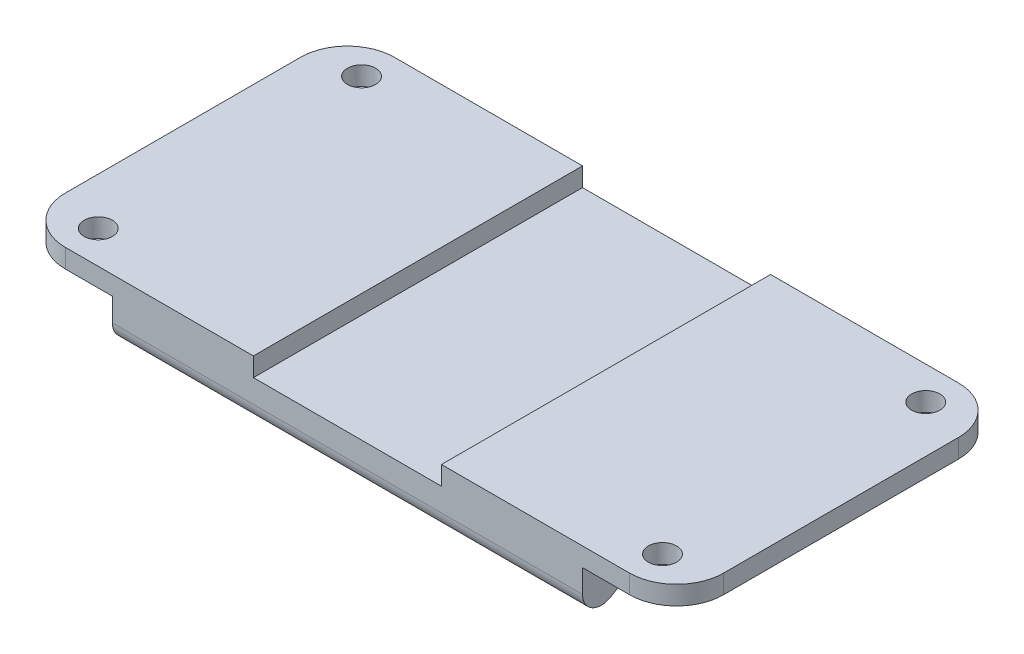
ISO-10303-21;
HEADER;
FILE_DESCRIPTION(('STEP AP214'),'2;1');
FILE_NAME('part.step','',(''),(''),'','','');
FILE_SCHEMA(('AUTOMOTIVE_DESIGN { 1 0 10303 214 1 1 1 1 }'));
ENDSEC;
DATA;
#1=APPLICATION_CONTEXT('core data for automotive mechanical design processes');
#2=APPLICATION_PROTOCOL_DEFINITION('international standard','automotive_design',2000,#1);
#3=PRODUCT_CONTEXT('',#1,'mechanical');
#4=PRODUCT('Part','Part','',(#3));
#5=PRODUCT_RELATED_PRODUCT_CATEGORY('part','',(#4));
#6=PRODUCT_DEFINITION_FORMATION('','',#4);
#7=PRODUCT_DEFINITION_CONTEXT('part definition',#1,'design');
#8=PRODUCT_DEFINITION('design','',#6,#7);
#9=PRODUCT_DEFINITION_SHAPE('','',#8);
#10=(LENGTH_UNIT() NAMED_UNIT(*) SI_UNIT(.MILLI.,.METRE.));
#11=(NAMED_UNIT(*) PLANE_ANGLE_UNIT() SI_UNIT($,.RADIAN.));
#12=(NAMED_UNIT(*) SI_UNIT($,.STERADIAN.) SOLID_ANGLE_UNIT());
#13=UNCERTAINTY_MEASURE_WITH_UNIT(LENGTH_MEASURE(1.E-05),#10,'distance_accuracy_value','');
#14=(GEOMETRIC_REPRESENTATION_CONTEXT(3) GLOBAL_UNCERTAINTY_ASSIGNED_CONTEXT((#13)) GLOBAL_UNIT_ASSIGNED_CONTEXT((#10,
#11,#12)) REPRESENTATION_CONTEXT('',''));
#15=CARTESIAN_POINT('',(0.,0.,0.));
#16=DIRECTION('',(0.,0.,1.));
#17=DIRECTION('',(1.,0.,0.));
#18=AXIS2_PLACEMENT_3D('',#15,#16,#17);
#19=CARTESIAN_POINT('',(0.,0.,0.));
#20=DIRECTION('',(0.,1.,0.));
#21=DIRECTION('',(0.,0.,1.));
#22=AXIS2_PLACEMENT_3D('',#19,#20,#21);
#23=PLANE('',#22);
#24=CARTESIAN_POINT('',(30.,0.,14.));
#25=DIRECTION('',(0.,1.,0.));
#26=DIRECTION('',(0.,0.,1.));
#27=AXIS2_PLACEMENT_3D('',#24,#25,#26);
#28=CIRCLE('',#27,1.5);
#29=CARTESIAN_POINT('',(30.,0.,15.5));
#30=VERTEX_POINT('',#29);
#31=EDGE_CURVE('E430',#30,#30,#28,.T.);
#32=ORIENTED_EDGE('',*,*,#31,.F.);
#33=EDGE_LOOP('',(#32));
#34=FACE_BOUND('',#33,.T.);
#35=CARTESIAN_POINT('',(30.,0.,-14.));
#36=DIRECTION('',(0.,1.,0.));
#37=DIRECTION('',(0.,0.,1.));
#38=AXIS2_PLACEMENT_3D('',#35,#36,#37);
#39=CIRCLE('',#38,1.5);
#40=CARTESIAN_POINT('',(30.,0.,-12.5));
#41=VERTEX_POINT('',#40);
#42=EDGE_CURVE('E445',#41,#41,#39,.F.);
#43=ORIENTED_EDGE('',*,*,#42,.T.);
#44=EDGE_LOOP('',(#43));
#45=FACE_BOUND('',#44,.T.);
#46=DIRECTION('',(1.,0.,0.));
#47=VECTOR('',#46,1.);
#48=CARTESIAN_POINT('',(25.,0.,17.5));
#49=LINE('',#48,#47);
#50=CARTESIAN_POINT('',(10.,0.,17.5));
#51=VERTEX_POINT('',#50);
#52=CARTESIAN_POINT('',(30.,0.,17.5));
#53=VERTEX_POINT('',#52);
#54=EDGE_CURVE('E212',#51,#53,#49,.T.);
#55=ORIENTED_EDGE('',*,*,#54,.T.);
#56=CARTESIAN_POINT('',(30.,0.,12.5));
#57=DIRECTION('',(0.,1.,0.));
#58=DIRECTION('',(0.,0.,1.));
#59=AXIS2_PLACEMENT_3D('',#56,#57,#58);
#60=CIRCLE('',#59,5.);
#61=CARTESIAN_POINT('',(35.,0.,12.5));
#62=VERTEX_POINT('',#61);
#63=EDGE_CURVE('E287',#53,#62,#60,.T.);
#64=ORIENTED_EDGE('',*,*,#63,.T.);
#65=DIRECTION('',(0.,0.,-1.));
#66=VECTOR('',#65,1.);
#67=CARTESIAN_POINT('',(35.,0.,0.));
#68=LINE('',#67,#66);
#69=CARTESIAN_POINT('',(35.,0.,-12.5));
#70=VERTEX_POINT('',#69);
#71=EDGE_CURVE('E374',#62,#70,#68,.T.);
#72=ORIENTED_EDGE('',*,*,#71,.T.);
#73=CARTESIAN_POINT('',(30.,0.,-12.5));
#74=DIRECTION('',(0.,1.,0.));
#75=DIRECTION('',(0.,0.,1.));
#76=AXIS2_PLACEMENT_3D('',#73,#74,#75);
#77=CIRCLE('',#76,5.);
#78=CARTESIAN_POINT('',(30.,0.,-17.5));
#79=VERTEX_POINT('',#78);
#80=EDGE_CURVE('E285',#70,#79,#77,.T.);
#81=ORIENTED_EDGE('',*,*,#80,.T.);
#82=DIRECTION('',(-1.,0.,0.));
#83=VECTOR('',#82,1.);
#84=CARTESIAN_POINT('',(25.,0.,-17.5));
#85=LINE('',#84,#83);
#86=CARTESIAN_POINT('',(10.,0.,-17.5));
#87=VERTEX_POINT('',#86);
#88=EDGE_CURVE('E209',#79,#87,#85,.T.);
#89=ORIENTED_EDGE('',*,*,#88,.T.);
#90=DIRECTION('',(0.,0.,1.));
#91=VECTOR('',#90,1.);
#92=CARTESIAN_POINT('',(10.,0.,-17.5));
#93=LINE('',#92,#91);
#94=EDGE_CURVE('E361',#87,#51,#93,.T.);
#95=ORIENTED_EDGE('',*,*,#94,.T.);
#96=EDGE_LOOP('',(#55,#64,#72,#81,#89,#95));
#97=FACE_BOUND('',#96,.T.);
#98=ADVANCED_FACE('F34',(#34,#45,#97),#23,.T.);
#99=CARTESIAN_POINT('',(25.,-8.,-17.5));
#100=DIRECTION('',(0.,0.,-1.));
#101=DIRECTION('',(-1.,0.,0.));
#102=AXIS2_PLACEMENT_3D('',#99,#100,#101);
#103=PLANE('',#102);
#104=ORIENTED_EDGE('',*,*,#88,.F.);
#105=DIRECTION('',(0.,-1.,0.));
#106=VECTOR('',#105,1.);
#107=CARTESIAN_POINT('',(30.,-8.,-17.5));
#108=LINE('',#107,#106);
#109=CARTESIAN_POINT('',(30.,-2.,-17.5));
#110=VERTEX_POINT('',#109);
#111=EDGE_CURVE('E298',#79,#110,#108,.T.);
#112=ORIENTED_EDGE('',*,*,#111,.T.);
#113=DIRECTION('',(-1.,0.,0.));
#114=VECTOR('',#113,1.);
#115=CARTESIAN_POINT('',(35.,-2.,-17.5));
#116=LINE('',#115,#114);
#117=CARTESIAN_POINT('',(25.,-2.,-17.5));
#118=VERTEX_POINT('',#117);
#119=EDGE_CURVE('E379',#110,#118,#116,.T.);
#120=ORIENTED_EDGE('',*,*,#119,.T.);
#121=DIRECTION('',(0.,1.,0.));
#122=VECTOR('',#121,1.);
#123=CARTESIAN_POINT('',(25.,-8.,-17.5));
#124=LINE('',#123,#122);
#125=CARTESIAN_POINT('',(25.,-4.46761924206188,-17.5));
#126=VERTEX_POINT('',#125);
#127=EDGE_CURVE('E220',#126,#118,#124,.T.);
#128=ORIENTED_EDGE('',*,*,#127,.F.);
#129=DIRECTION('',(-1.,0.,0.));
#130=VECTOR('',#129,1.);
#131=CARTESIAN_POINT('',(-25.,-4.46761924206187,-17.5));
#132=LINE('',#131,#130);
#133=CARTESIAN_POINT('',(-25.,-4.46761924206187,-17.5));
#134=VERTEX_POINT('',#133);
#135=EDGE_CURVE('E244',#126,#134,#132,.T.);
#136=ORIENTED_EDGE('',*,*,#135,.T.);
#137=DIRECTION('',(0.,1.,0.));
#138=VECTOR('',#137,1.);
#139=CARTESIAN_POINT('',(-25.,-8.,-17.5));
#140=LINE('',#139,#138);
#141=CARTESIAN_POINT('',(-25.,-2.,-17.5));
#142=VERTEX_POINT('',#141);
#143=EDGE_CURVE('E216',#134,#142,#140,.T.);
#144=ORIENTED_EDGE('',*,*,#143,.T.);
#145=DIRECTION('',(1.,0.,0.));
#146=VECTOR('',#145,1.);
#147=CARTESIAN_POINT('',(-35.,-2.,-17.5));
#148=LINE('',#147,#146);
#149=CARTESIAN_POINT('',(-30.,-2.,-17.5));
#150=VERTEX_POINT('',#149);
#151=EDGE_CURVE('E337',#150,#142,#148,.T.);
#152=ORIENTED_EDGE('',*,*,#151,.F.);
#153=DIRECTION('',(0.,-1.,0.));
#154=VECTOR('',#153,1.);
#155=CARTESIAN_POINT('',(-30.,-8.,-17.5));
#156=LINE('',#155,#154);
#157=CARTESIAN_POINT('',(-30.,0.,-17.5));
#158=VERTEX_POINT('',#157);
#159=EDGE_CURVE('E208',#150,#158,#156,.F.);
#160=ORIENTED_EDGE('',*,*,#159,.T.);
#161=CARTESIAN_POINT('',(-10.,0.,-17.5));
#162=VERTEX_POINT('',#161);
#163=EDGE_CURVE('E199',#162,#158,#85,.T.);
#164=ORIENTED_EDGE('',*,*,#163,.F.);
#165=DIRECTION('',(0.,-1.,0.));
#166=VECTOR('',#165,1.);
#167=CARTESIAN_POINT('',(-10.,0.,-17.5));
#168=LINE('',#167,#166);
#169=CARTESIAN_POINT('',(-10.,-2.,-17.5));
#170=VERTEX_POINT('',#169);
#171=EDGE_CURVE('E183',#162,#170,#168,.T.);
#172=ORIENTED_EDGE('',*,*,#171,.T.);
#173=DIRECTION('',(1.,0.,0.));
#174=VECTOR('',#173,1.);
#175=CARTESIAN_POINT('',(0.,-2.,-17.5));
#176=LINE('',#175,#174);
#177=CARTESIAN_POINT('',(10.,-2.,-17.5));
#178=VERTEX_POINT('',#177);
#179=EDGE_CURVE('E194',#170,#178,#176,.T.);
#180=ORIENTED_EDGE('',*,*,#179,.T.);
#181=DIRECTION('',(0.,-1.,0.));
#182=VECTOR('',#181,1.);
#183=CARTESIAN_POINT('',(10.,0.,-17.5));
#184=LINE('',#183,#182);
#185=EDGE_CURVE('E202',#87,#178,#184,.T.);
#186=ORIENTED_EDGE('',*,*,#185,.F.);
#187=EDGE_LOOP('',(#104,#112,#120,#128,#136,#144,#152,#160,#164,#172,#180,#186));
#188=FACE_BOUND('',#187,.T.);
#189=ADVANCED_FACE('F205',(#188),#103,.T.);
#190=CARTESIAN_POINT('',(25.,-8.,17.5));
#191=DIRECTION('',(0.,0.,1.));
#192=DIRECTION('',(1.,0.,0.));
#193=AXIS2_PLACEMENT_3D('',#190,#191,#192);
#194=PLANE('',#193);
#195=DIRECTION('',(-1.,0.,0.));
#196=VECTOR('',#195,1.);
#197=CARTESIAN_POINT('',(35.,-2.,17.5));
#198=LINE('',#197,#196);
#199=CARTESIAN_POINT('',(30.,-2.,17.5));
#200=VERTEX_POINT('',#199);
#201=CARTESIAN_POINT('',(25.,-2.,17.5));
#202=VERTEX_POINT('',#201);
#203=EDGE_CURVE('E331',#200,#202,#198,.T.);
#204=ORIENTED_EDGE('',*,*,#203,.F.);
#205=DIRECTION('',(0.,1.,0.));
#206=VECTOR('',#205,1.);
#207=CARTESIAN_POINT('',(30.,-8.,17.5));
#208=LINE('',#207,#206);
#209=EDGE_CURVE('E282',#200,#53,#208,.T.);
#210=ORIENTED_EDGE('',*,*,#209,.T.);
#211=ORIENTED_EDGE('',*,*,#54,.F.);
#212=DIRECTION('',(0.,-1.,0.));
#213=VECTOR('',#212,1.);
#214=CARTESIAN_POINT('',(10.,0.,17.5));
#215=LINE('',#214,#213);
#216=CARTESIAN_POINT('',(10.,-2.,17.5));
#217=VERTEX_POINT('',#216);
#218=EDGE_CURVE('E195',#51,#217,#215,.T.);
#219=ORIENTED_EDGE('',*,*,#218,.T.);
#220=DIRECTION('',(1.,0.,0.));
#221=VECTOR('',#220,1.);
#222=CARTESIAN_POINT('',(0.,-2.,17.5));
#223=LINE('',#222,#221);
#224=CARTESIAN_POINT('',(-10.,-2.,17.5));
#225=VERTEX_POINT('',#224);
#226=EDGE_CURVE('E437',#225,#217,#223,.T.);
#227=ORIENTED_EDGE('',*,*,#226,.F.);
#228=DIRECTION('',(0.,-1.,0.));
#229=VECTOR('',#228,1.);
#230=CARTESIAN_POINT('',(-10.,0.,17.5));
#231=LINE('',#230,#229);
#232=CARTESIAN_POINT('',(-10.,0.,17.5));
#233=VERTEX_POINT('',#232);
#234=EDGE_CURVE('E315',#233,#225,#231,.T.);
#235=ORIENTED_EDGE('',*,*,#234,.F.);
#236=CARTESIAN_POINT('',(-30.,0.,17.5));
#237=VERTEX_POINT('',#236);
#238=EDGE_CURVE('E201',#237,#233,#49,.T.);
#239=ORIENTED_EDGE('',*,*,#238,.F.);
#240=DIRECTION('',(0.,1.,0.));
#241=VECTOR('',#240,1.);
#242=CARTESIAN_POINT('',(-30.,-8.,17.5));
#243=LINE('',#242,#241);
#244=CARTESIAN_POINT('',(-30.,-2.,17.5));
#245=VERTEX_POINT('',#244);
#246=EDGE_CURVE('E266',#237,#245,#243,.F.);
#247=ORIENTED_EDGE('',*,*,#246,.T.);
#248=DIRECTION('',(1.,0.,0.));
#249=VECTOR('',#248,1.);
#250=CARTESIAN_POINT('',(-35.,-2.,17.5));
#251=LINE('',#250,#249);
#252=CARTESIAN_POINT('',(-25.,-2.,17.5));
#253=VERTEX_POINT('',#252);
#254=EDGE_CURVE('E324',#245,#253,#251,.T.);
#255=ORIENTED_EDGE('',*,*,#254,.T.);
#256=DIRECTION('',(0.,1.,0.));
#257=VECTOR('',#256,1.);
#258=CARTESIAN_POINT('',(-25.,-8.,17.5));
#259=LINE('',#258,#257);
#260=CARTESIAN_POINT('',(-25.,-4.46761924206188,17.5));
#261=VERTEX_POINT('',#260);
#262=EDGE_CURVE('E211',#261,#253,#259,.T.);
#263=ORIENTED_EDGE('',*,*,#262,.F.);
#264=DIRECTION('',(1.,0.,0.));
#265=VECTOR('',#264,1.);
#266=CARTESIAN_POINT('',(25.,-4.46761924206188,17.5));
#267=LINE('',#266,#265);
#268=CARTESIAN_POINT('',(25.,-4.46761924206188,17.5));
#269=VERTEX_POINT('',#268);
#270=EDGE_CURVE('E255',#261,#269,#267,.T.);
#271=ORIENTED_EDGE('',*,*,#270,.T.);
#272=DIRECTION('',(0.,1.,0.));
#273=VECTOR('',#272,1.);
#274=CARTESIAN_POINT('',(25.,-8.,17.5));
#275=LINE('',#274,#273);
#276=EDGE_CURVE('E223',#269,#202,#275,.T.);
#277=ORIENTED_EDGE('',*,*,#276,.T.);
#278=EDGE_LOOP('',(#204,#210,#211,#219,#227,#235,#239,#247,#255,#263,#271,#277));
#279=FACE_BOUND('',#278,.T.);
#280=ADVANCED_FACE('F312',(#279),#194,.T.);
#281=ORIENTED_EDGE('',*,*,#163,.T.);
#282=CARTESIAN_POINT('',(-30.,0.,-12.5));
#283=DIRECTION('',(0.,1.,0.));
#284=DIRECTION('',(0.,0.,1.));
#285=AXIS2_PLACEMENT_3D('',#282,#283,#284);
#286=CIRCLE('',#285,5.);
#287=CARTESIAN_POINT('',(-35.,0.,-12.5));
#288=VERTEX_POINT('',#287);
#289=EDGE_CURVE('E11',#158,#288,#286,.T.);
#290=ORIENTED_EDGE('',*,*,#289,.T.);
#291=DIRECTION('',(0.,0.,-1.));
#292=VECTOR('',#291,1.);
#293=CARTESIAN_POINT('',(-35.,0.,0.));
#294=LINE('',#293,#292);
#295=CARTESIAN_POINT('',(-35.,0.,12.5));
#296=VERTEX_POINT('',#295);
#297=EDGE_CURVE('E309',#296,#288,#294,.T.);
#298=ORIENTED_EDGE('',*,*,#297,.F.);
#299=CARTESIAN_POINT('',(-30.,0.,12.5));
#300=DIRECTION('',(0.,1.,0.));
#301=DIRECTION('',(0.,0.,1.));
#302=AXIS2_PLACEMENT_3D('',#299,#300,#301);
#303=CIRCLE('',#302,5.);
#304=EDGE_CURVE('E42',#296,#237,#303,.T.);
#305=ORIENTED_EDGE('',*,*,#304,.T.);
#306=ORIENTED_EDGE('',*,*,#238,.T.);
#307=DIRECTION('',(0.,0.,1.));
#308=VECTOR('',#307,1.);
#309=CARTESIAN_POINT('',(-10.,0.,-17.5));
#310=LINE('',#309,#308);
#311=EDGE_CURVE('E187',#162,#233,#310,.T.);
#312=ORIENTED_EDGE('',*,*,#311,.F.);
#313=EDGE_LOOP('',(#281,#290,#298,#305,#306,#312));
#314=FACE_BOUND('',#313,.T.);
#315=CARTESIAN_POINT('',(-30.,0.,-14.));
#316=DIRECTION('',(0.,1.,0.));
#317=DIRECTION('',(0.,0.,1.));
#318=AXIS2_PLACEMENT_3D('',#315,#316,#317);
#319=CIRCLE('',#318,1.5);
#320=CARTESIAN_POINT('',(-30.,0.,-12.5));
#321=VERTEX_POINT('',#320);
#322=EDGE_CURVE('E271',#321,#321,#319,.T.);
#323=ORIENTED_EDGE('',*,*,#322,.F.);
#324=EDGE_LOOP('',(#323));
#325=FACE_BOUND('',#324,.T.);
#326=CARTESIAN_POINT('',(-30.,0.,14.));
#327=DIRECTION('',(0.,1.,0.));
#328=DIRECTION('',(0.,0.,1.));
#329=AXIS2_PLACEMENT_3D('',#326,#327,#328);
#330=CIRCLE('',#329,1.5);
#331=CARTESIAN_POINT('',(-30.,0.,15.5));
#332=VERTEX_POINT('',#331);
#333=EDGE_CURVE('E446',#332,#332,#330,.F.);
#334=ORIENTED_EDGE('',*,*,#333,.T.);
#335=EDGE_LOOP('',(#334));
#336=FACE_BOUND('',#335,.T.);
#337=ADVANCED_FACE('F197',(#314,#325,#336),#23,.T.);
#338=CARTESIAN_POINT('',(-35.,-2.,0.));
#339=DIRECTION('',(0.,1.,0.));
#340=DIRECTION('',(0.,0.,1.));
#341=AXIS2_PLACEMENT_3D('',#338,#339,#340);
#342=PLANE('',#341);
#343=CARTESIAN_POINT('',(-30.,-2.,-14.));
#344=DIRECTION('',(0.,1.,0.));
#345=DIRECTION('',(0.,0.,1.));
#346=AXIS2_PLACEMENT_3D('',#343,#344,#345);
#347=CIRCLE('',#346,1.5);
#348=CARTESIAN_POINT('',(-30.,-2.,-12.5));
#349=VERTEX_POINT('',#348);
#350=EDGE_CURVE('E274',#349,#349,#347,.T.);
#351=ORIENTED_EDGE('',*,*,#350,.T.);
#352=EDGE_LOOP('',(#351));
#353=FACE_BOUND('',#352,.T.);
#354=DIRECTION('',(0.,0.,1.));
#355=VECTOR('',#354,1.);
#356=CARTESIAN_POINT('',(-35.,-2.,0.));
#357=LINE('',#356,#355);
#358=CARTESIAN_POINT('',(-35.,-2.,-12.5));
#359=VERTEX_POINT('',#358);
#360=CARTESIAN_POINT('',(-35.,-2.,12.5));
#361=VERTEX_POINT('',#360);
#362=EDGE_CURVE('E322',#359,#361,#357,.T.);
#363=ORIENTED_EDGE('',*,*,#362,.F.);
#364=CARTESIAN_POINT('',(-30.,-2.,-12.5));
#365=DIRECTION('',(0.,1.,0.));
#366=DIRECTION('',(0.,0.,1.));
#367=AXIS2_PLACEMENT_3D('',#364,#365,#366);
#368=CIRCLE('',#367,5.);
#369=EDGE_CURVE('E308',#359,#150,#368,.F.);
#370=ORIENTED_EDGE('',*,*,#369,.T.);
#371=ORIENTED_EDGE('',*,*,#151,.T.);
#372=DIRECTION('',(0.,0.,1.));
#373=VECTOR('',#372,1.);
#374=CARTESIAN_POINT('',(-25.,-2.,0.));
#375=LINE('',#374,#373);
#376=EDGE_CURVE('E328',#142,#253,#375,.T.);
#377=ORIENTED_EDGE('',*,*,#376,.T.);
#378=ORIENTED_EDGE('',*,*,#254,.F.);
#379=CARTESIAN_POINT('',(-30.,-2.,12.5));
#380=DIRECTION('',(0.,1.,0.));
#381=DIRECTION('',(0.,0.,1.));
#382=AXIS2_PLACEMENT_3D('',#379,#380,#381);
#383=CIRCLE('',#382,5.);
#384=EDGE_CURVE('E306',#245,#361,#383,.F.);
#385=ORIENTED_EDGE('',*,*,#384,.T.);
#386=EDGE_LOOP('',(#363,#370,#371,#377,#378,#385));
#387=FACE_BOUND('',#386,.T.);
#388=CARTESIAN_POINT('',(-30.,-2.,14.));
#389=DIRECTION('',(0.,1.,0.));
#390=DIRECTION('',(0.,0.,1.));
#391=AXIS2_PLACEMENT_3D('',#388,#389,#390);
#392=CIRCLE('',#391,1.5);
#393=CARTESIAN_POINT('',(-30.,-2.,15.5));
#394=VERTEX_POINT('',#393);
#395=EDGE_CURVE('E277',#394,#394,#392,.F.);
#396=ORIENTED_EDGE('',*,*,#395,.F.);
#397=EDGE_LOOP('',(#396));
#398=FACE_BOUND('',#397,.T.);
#399=ADVANCED_FACE('F320',(#353,#387,#398),#342,.F.);
#400=CARTESIAN_POINT('',(35.,-2.,0.));
#401=DIRECTION('',(0.,-1.,0.));
#402=DIRECTION('',(0.,0.,-1.));
#403=AXIS2_PLACEMENT_3D('',#400,#401,#402);
#404=PLANE('',#403);
#405=DIRECTION('',(0.,0.,1.));
#406=VECTOR('',#405,1.);
#407=CARTESIAN_POINT('',(35.,-2.,0.));
#408=LINE('',#407,#406);
#409=CARTESIAN_POINT('',(35.,-2.,-12.5));
#410=VERTEX_POINT('',#409);
#411=CARTESIAN_POINT('',(35.,-2.,12.5));
#412=VERTEX_POINT('',#411);
#413=EDGE_CURVE('E372',#410,#412,#408,.T.);
#414=ORIENTED_EDGE('',*,*,#413,.T.);
#415=CARTESIAN_POINT('',(30.,-2.,12.5));
#416=DIRECTION('',(0.,-1.,0.));
#417=DIRECTION('',(0.,0.,-1.));
#418=AXIS2_PLACEMENT_3D('',#415,#416,#417);
#419=CIRCLE('',#418,5.);
#420=EDGE_CURVE('E295',#412,#200,#419,.T.);
#421=ORIENTED_EDGE('',*,*,#420,.T.);
#422=ORIENTED_EDGE('',*,*,#203,.T.);
#423=DIRECTION('',(0.,0.,1.));
#424=VECTOR('',#423,1.);
#425=CARTESIAN_POINT('',(25.,-2.,0.));
#426=LINE('',#425,#424);
#427=EDGE_CURVE('E280',#118,#202,#426,.T.);
#428=ORIENTED_EDGE('',*,*,#427,.F.);
#429=ORIENTED_EDGE('',*,*,#119,.F.);
#430=CARTESIAN_POINT('',(30.,-2.,-12.5));
#431=DIRECTION('',(0.,-1.,0.));
#432=DIRECTION('',(0.,0.,-1.));
#433=AXIS2_PLACEMENT_3D('',#430,#431,#432);
#434=CIRCLE('',#433,5.);
#435=EDGE_CURVE('E293',#110,#410,#434,.T.);
#436=ORIENTED_EDGE('',*,*,#435,.T.);
#437=EDGE_LOOP('',(#414,#421,#422,#428,#429,#436));
#438=FACE_BOUND('',#437,.T.);
#439=CARTESIAN_POINT('',(30.,-2.,14.));
#440=DIRECTION('',(0.,-1.,0.));
#441=DIRECTION('',(0.,0.,-1.));
#442=AXIS2_PLACEMENT_3D('',#439,#440,#441);
#443=CIRCLE('',#442,1.5);
#444=CARTESIAN_POINT('',(30.,-2.,12.5));
#445=VERTEX_POINT('',#444);
#446=EDGE_CURVE('E267',#445,#445,#443,.T.);
#447=ORIENTED_EDGE('',*,*,#446,.F.);
#448=EDGE_LOOP('',(#447));
#449=FACE_BOUND('',#448,.T.);
#450=CARTESIAN_POINT('',(30.,-2.,-14.));
#451=DIRECTION('',(0.,-1.,0.));
#452=DIRECTION('',(0.,0.,-1.));
#453=AXIS2_PLACEMENT_3D('',#450,#451,#452);
#454=CIRCLE('',#453,1.5);
#455=CARTESIAN_POINT('',(30.,-2.,-15.5));
#456=VERTEX_POINT('',#455);
#457=EDGE_CURVE('E270',#456,#456,#454,.F.);
#458=ORIENTED_EDGE('',*,*,#457,.T.);
#459=EDGE_LOOP('',(#458));
#460=FACE_BOUND('',#459,.T.);
#461=ADVANCED_FACE('F376',(#438,#449,#460),#404,.T.);
#462=CARTESIAN_POINT('',(25.,-8.,17.5));
#463=DIRECTION('',(1.,0.,0.));
#464=DIRECTION('',(0.,0.,-1.));
#465=AXIS2_PLACEMENT_3D('',#462,#463,#464);
#466=PLANE('',#465);
#467=ORIENTED_EDGE('',*,*,#127,.T.);
#468=ORIENTED_EDGE('',*,*,#427,.T.);
#469=ORIENTED_EDGE('',*,*,#276,.F.);
#470=CARTESIAN_POINT('',(25.,-4.46761924206188,15.5));
#471=DIRECTION('',(1.,0.,0.));
#472=DIRECTION('',(0.,0.,-1.));
#473=AXIS2_PLACEMENT_3D('',#470,#471,#472);
#474=CIRCLE('',#473,2.);
#475=CARTESIAN_POINT('',(25.,-6.18260509348697,14.4710084891449));
#476=VERTEX_POINT('',#475);
#477=EDGE_CURVE('E251',#269,#476,#474,.T.);
#478=ORIENTED_EDGE('',*,*,#477,.T.);
#479=DIRECTION('',(0.,0.514495755427527,-0.857492925712544));
#480=VECTOR('',#479,1.);
#481=CARTESIAN_POINT('',(25.,-8.,17.5));
#482=LINE('',#481,#480);
#483=CARTESIAN_POINT('',(25.,-5.28501414857491,12.9750235809582));
#484=VERTEX_POINT('',#483);
#485=EDGE_CURVE('E350',#476,#484,#482,.T.);
#486=ORIENTED_EDGE('',*,*,#485,.T.);
#487=CARTESIAN_POINT('',(25.,-7.,11.9460320701031));
#488=DIRECTION('',(1.,0.,0.));
#489=DIRECTION('',(0.,0.,-1.));
#490=AXIS2_PLACEMENT_3D('',#487,#488,#489);
#491=CIRCLE('',#490,2.);
#492=CARTESIAN_POINT('',(25.,-5.,11.9460320701031));
#493=VERTEX_POINT('',#492);
#494=EDGE_CURVE('E258',#484,#493,#491,.F.);
#495=ORIENTED_EDGE('',*,*,#494,.T.);
#496=DIRECTION('',(0.,0.,-1.));
#497=VECTOR('',#496,1.);
#498=CARTESIAN_POINT('',(25.,-5.,17.5));
#499=LINE('',#498,#497);
#500=CARTESIAN_POINT('',(25.,-5.,-11.9460320701031));
#501=VERTEX_POINT('',#500);
#502=EDGE_CURVE('E219',#493,#501,#499,.T.);
#503=ORIENTED_EDGE('',*,*,#502,.T.);
#504=CARTESIAN_POINT('',(25.,-7.,-11.9460320701031));
#505=DIRECTION('',(1.,0.,0.));
#506=DIRECTION('',(0.,0.,-1.));
#507=AXIS2_PLACEMENT_3D('',#504,#505,#506);
#508=CIRCLE('',#507,2.);
#509=CARTESIAN_POINT('',(25.,-5.28501414857491,-12.9750235809582));
#510=VERTEX_POINT('',#509);
#511=EDGE_CURVE('E262',#501,#510,#508,.F.);
#512=ORIENTED_EDGE('',*,*,#511,.T.);
#513=DIRECTION('',(0.,0.514495755427526,0.857492925712544));
#514=VECTOR('',#513,1.);
#515=CARTESIAN_POINT('',(25.,7.44117647058823,8.23529411764706));
#516=LINE('',#515,#514);
#517=CARTESIAN_POINT('',(25.,-6.18260509348697,-14.471008489145));
#518=VERTEX_POINT('',#517);
#519=EDGE_CURVE('E348',#518,#510,#516,.T.);
#520=ORIENTED_EDGE('',*,*,#519,.F.);
#521=CARTESIAN_POINT('',(25.,-4.46761924206188,-15.5));
#522=DIRECTION('',(1.,0.,0.));
#523=DIRECTION('',(0.,0.,-1.));
#524=AXIS2_PLACEMENT_3D('',#521,#522,#523);
#525=CIRCLE('',#524,2.);
#526=EDGE_CURVE('E253',#518,#126,#525,.T.);
#527=ORIENTED_EDGE('',*,*,#526,.T.);
#528=EDGE_LOOP('',(#467,#468,#469,#478,#486,#495,#503,#512,#520,#527));
#529=FACE_BOUND('',#528,.T.);
#530=ADVANCED_FACE('F387',(#529),#466,.T.);
#531=CARTESIAN_POINT('',(-25.,-8.,17.5));
#532=DIRECTION('',(-1.,0.,0.));
#533=DIRECTION('',(0.,0.,1.));
#534=AXIS2_PLACEMENT_3D('',#531,#532,#533);
#535=PLANE('',#534);
#536=ORIENTED_EDGE('',*,*,#376,.F.);
#537=ORIENTED_EDGE('',*,*,#143,.F.);
#538=CARTESIAN_POINT('',(-25.,-4.46761924206187,-15.5));
#539=DIRECTION('',(-1.,0.,0.));
#540=DIRECTION('',(0.,0.,1.));
#541=AXIS2_PLACEMENT_3D('',#538,#539,#540);
#542=CIRCLE('',#541,2.);
#543=CARTESIAN_POINT('',(-25.,-6.18260509348697,-14.471008489145));
#544=VERTEX_POINT('',#543);
#545=EDGE_CURVE('E249',#134,#544,#542,.T.);
#546=ORIENTED_EDGE('',*,*,#545,.T.);
#547=DIRECTION('',(0.,0.514495755427526,0.857492925712544));
#548=VECTOR('',#547,1.);
#549=CARTESIAN_POINT('',(-25.,1.83823529411765,-1.10294117647059));
#550=LINE('',#549,#548);
#551=CARTESIAN_POINT('',(-25.,-5.28501414857491,-12.9750235809582));
#552=VERTEX_POINT('',#551);
#553=EDGE_CURVE('E339',#544,#552,#550,.T.);
#554=ORIENTED_EDGE('',*,*,#553,.T.);
#555=CARTESIAN_POINT('',(-25.,-7.,-11.9460320701031));
#556=DIRECTION('',(-1.,0.,0.));
#557=DIRECTION('',(0.,0.,1.));
#558=AXIS2_PLACEMENT_3D('',#555,#556,#557);
#559=CIRCLE('',#558,2.);
#560=CARTESIAN_POINT('',(-25.,-5.,-11.9460320701031));
#561=VERTEX_POINT('',#560);
#562=EDGE_CURVE('E264',#552,#561,#559,.F.);
#563=ORIENTED_EDGE('',*,*,#562,.T.);
#564=DIRECTION('',(0.,0.,-1.));
#565=VECTOR('',#564,1.);
#566=CARTESIAN_POINT('',(-25.,-5.,0.));
#567=LINE('',#566,#565);
#568=CARTESIAN_POINT('',(-25.,-5.,11.9460320701031));
#569=VERTEX_POINT('',#568);
#570=EDGE_CURVE('E342',#569,#561,#567,.T.);
#571=ORIENTED_EDGE('',*,*,#570,.F.);
#572=CARTESIAN_POINT('',(-25.,-7.,11.9460320701031));
#573=DIRECTION('',(-1.,0.,0.));
#574=DIRECTION('',(0.,0.,1.));
#575=AXIS2_PLACEMENT_3D('',#572,#573,#574);
#576=CIRCLE('',#575,2.);
#577=CARTESIAN_POINT('',(-25.,-5.28501414857491,12.9750235809582));
#578=VERTEX_POINT('',#577);
#579=EDGE_CURVE('E260',#569,#578,#576,.F.);
#580=ORIENTED_EDGE('',*,*,#579,.T.);
#581=DIRECTION('',(0.,0.514495755427527,-0.857492925712544));
#582=VECTOR('',#581,1.);
#583=CARTESIAN_POINT('',(-25.,1.83823529411765,1.10294117647059));
#584=LINE('',#583,#582);
#585=CARTESIAN_POINT('',(-25.,-6.18260509348697,14.471008489145));
#586=VERTEX_POINT('',#585);
#587=EDGE_CURVE('E345',#586,#578,#584,.T.);
#588=ORIENTED_EDGE('',*,*,#587,.F.);
#589=CARTESIAN_POINT('',(-25.,-4.46761924206188,15.5));
#590=DIRECTION('',(-1.,0.,0.));
#591=DIRECTION('',(0.,0.,1.));
#592=AXIS2_PLACEMENT_3D('',#589,#590,#591);
#593=CIRCLE('',#592,2.);
#594=EDGE_CURVE('E247',#586,#261,#593,.T.);
#595=ORIENTED_EDGE('',*,*,#594,.T.);
#596=ORIENTED_EDGE('',*,*,#262,.T.);
#597=EDGE_LOOP('',(#536,#537,#546,#554,#563,#571,#580,#588,#595,#596));
#598=FACE_BOUND('',#597,.T.);
#599=ADVANCED_FACE('F487',(#598),#535,.T.);
#600=CARTESIAN_POINT('',(-25.,1.83823529411765,1.10294117647059));
#601=DIRECTION('',(0.,-0.857492925712544,-0.514495755427527));
#602=DIRECTION('',(0.,0.514495755427527,-0.857492925712544));
#603=AXIS2_PLACEMENT_3D('',#600,#601,#602);
#604=PLANE('',#603);
#605=ORIENTED_EDGE('',*,*,#587,.T.);
#606=DIRECTION('',(1.,0.,0.));
#607=VECTOR('',#606,1.);
#608=CARTESIAN_POINT('',(25.,-5.28501414857491,12.9750235809582));
#609=LINE('',#608,#607);
#610=EDGE_CURVE('E232',#578,#484,#609,.T.);
#611=ORIENTED_EDGE('',*,*,#610,.T.);
#612=ORIENTED_EDGE('',*,*,#485,.F.);
#613=DIRECTION('',(1.,0.,0.));
#614=VECTOR('',#613,1.);
#615=CARTESIAN_POINT('',(-25.,-6.18260509348697,14.4710084891449));
#616=LINE('',#615,#614);
#617=EDGE_CURVE('E230',#476,#586,#616,.F.);
#618=ORIENTED_EDGE('',*,*,#617,.T.);
#619=EDGE_LOOP('',(#605,#611,#612,#618));
#620=FACE_BOUND('',#619,.T.);
#621=ADVANCED_FACE('F396',(#620),#604,.T.);
#622=CARTESIAN_POINT('',(-25.,-5.,0.));
#623=DIRECTION('',(0.,-1.,0.));
#624=DIRECTION('',(0.,0.,-1.));
#625=AXIS2_PLACEMENT_3D('',#622,#623,#624);
#626=PLANE('',#625);
#627=ORIENTED_EDGE('',*,*,#502,.F.);
#628=DIRECTION('',(1.,0.,0.));
#629=VECTOR('',#628,1.);
#630=CARTESIAN_POINT('',(-25.,-5.,11.9460320701031));
#631=LINE('',#630,#629);
#632=EDGE_CURVE('E238',#493,#569,#631,.F.);
#633=ORIENTED_EDGE('',*,*,#632,.T.);
#634=ORIENTED_EDGE('',*,*,#570,.T.);
#635=DIRECTION('',(1.,0.,0.));
#636=VECTOR('',#635,1.);
#637=CARTESIAN_POINT('',(-25.,-5.,-11.9460320701031));
#638=LINE('',#637,#636);
#639=EDGE_CURVE('E235',#561,#501,#638,.T.);
#640=ORIENTED_EDGE('',*,*,#639,.T.);
#641=EDGE_LOOP('',(#627,#633,#634,#640));
#642=FACE_BOUND('',#641,.T.);
#643=ADVANCED_FACE('F405',(#642),#626,.T.);
#644=CARTESIAN_POINT('',(-25.,1.83823529411765,-1.10294117647059));
#645=DIRECTION('',(0.,0.857492925712544,-0.514495755427526));
#646=DIRECTION('',(0.,0.514495755427526,0.857492925712544));
#647=AXIS2_PLACEMENT_3D('',#644,#645,#646);
#648=PLANE('',#647);
#649=ORIENTED_EDGE('',*,*,#519,.T.);
#650=DIRECTION('',(1.,0.,0.));
#651=VECTOR('',#650,1.);
#652=CARTESIAN_POINT('',(-25.,-5.28501414857491,-12.9750235809582));
#653=LINE('',#652,#651);
#654=EDGE_CURVE('E242',#510,#552,#653,.F.);
#655=ORIENTED_EDGE('',*,*,#654,.T.);
#656=ORIENTED_EDGE('',*,*,#553,.F.);
#657=DIRECTION('',(-1.,0.,0.));
#658=VECTOR('',#657,1.);
#659=CARTESIAN_POINT('',(25.,-6.18260509348697,-14.471008489145));
#660=LINE('',#659,#658);
#661=EDGE_CURVE('E240',#544,#518,#660,.F.);
#662=ORIENTED_EDGE('',*,*,#661,.T.);
#663=EDGE_LOOP('',(#649,#655,#656,#662));
#664=FACE_BOUND('',#663,.T.);
#665=ADVANCED_FACE('F415',(#664),#648,.F.);
#666=CARTESIAN_POINT('',(-25.,-7.,11.9460320701031));
#667=DIRECTION('',(-1.,0.,0.));
#668=DIRECTION('',(0.,0.,1.));
#669=AXIS2_PLACEMENT_3D('',#666,#667,#668);
#670=CYLINDRICAL_SURFACE('',#669,2.);
#671=ORIENTED_EDGE('',*,*,#579,.F.);
#672=ORIENTED_EDGE('',*,*,#632,.F.);
#673=ORIENTED_EDGE('',*,*,#494,.F.);
#674=ORIENTED_EDGE('',*,*,#610,.F.);
#675=EDGE_LOOP('',(#671,#672,#673,#674));
#676=FACE_BOUND('',#675,.T.);
#677=ADVANCED_FACE('F401',(#676),#670,.F.);
#678=CARTESIAN_POINT('',(-25.,-7.,-11.9460320701031));
#679=DIRECTION('',(1.,0.,0.));
#680=DIRECTION('',(0.,0.,-1.));
#681=AXIS2_PLACEMENT_3D('',#678,#679,#680);
#682=CYLINDRICAL_SURFACE('',#681,2.);
#683=ORIENTED_EDGE('',*,*,#562,.F.);
#684=ORIENTED_EDGE('',*,*,#654,.F.);
#685=ORIENTED_EDGE('',*,*,#511,.F.);
#686=ORIENTED_EDGE('',*,*,#639,.F.);
#687=EDGE_LOOP('',(#683,#684,#685,#686));
#688=FACE_BOUND('',#687,.T.);
#689=ADVANCED_FACE('F410',(#688),#682,.F.);
#690=CARTESIAN_POINT('',(25.,-4.46761924206188,-15.5));
#691=DIRECTION('',(1.,0.,0.));
#692=DIRECTION('',(0.,0.,-1.));
#693=AXIS2_PLACEMENT_3D('',#690,#691,#692);
#694=CYLINDRICAL_SURFACE('',#693,2.);
#695=ORIENTED_EDGE('',*,*,#526,.F.);
#696=ORIENTED_EDGE('',*,*,#661,.F.);
#697=ORIENTED_EDGE('',*,*,#545,.F.);
#698=ORIENTED_EDGE('',*,*,#135,.F.);
#699=EDGE_LOOP('',(#695,#696,#697,#698));
#700=FACE_BOUND('',#699,.T.);
#701=ADVANCED_FACE('F419',(#700),#694,.T.);
#702=CARTESIAN_POINT('',(25.,-4.46761924206188,15.5));
#703=DIRECTION('',(1.,0.,0.));
#704=DIRECTION('',(0.,0.,-1.));
#705=AXIS2_PLACEMENT_3D('',#702,#703,#704);
#706=CYLINDRICAL_SURFACE('',#705,2.);
#707=ORIENTED_EDGE('',*,*,#594,.F.);
#708=ORIENTED_EDGE('',*,*,#617,.F.);
#709=ORIENTED_EDGE('',*,*,#477,.F.);
#710=ORIENTED_EDGE('',*,*,#270,.F.);
#711=EDGE_LOOP('',(#707,#708,#709,#710));
#712=FACE_BOUND('',#711,.T.);
#713=ADVANCED_FACE('F393',(#712),#706,.T.);
#714=CARTESIAN_POINT('',(-35.,0.,0.));
#715=DIRECTION('',(-1.,0.,0.));
#716=DIRECTION('',(0.,0.,1.));
#717=AXIS2_PLACEMENT_3D('',#714,#715,#716);
#718=PLANE('',#717);
#719=ORIENTED_EDGE('',*,*,#297,.T.);
#720=DIRECTION('',(0.,-1.,0.));
#721=VECTOR('',#720,1.);
#722=CARTESIAN_POINT('',(-35.,0.,-12.5));
#723=LINE('',#722,#721);
#724=EDGE_CURVE('E303',#288,#359,#723,.T.);
#725=ORIENTED_EDGE('',*,*,#724,.T.);
#726=ORIENTED_EDGE('',*,*,#362,.T.);
#727=DIRECTION('',(0.,1.,0.));
#728=VECTOR('',#727,1.);
#729=CARTESIAN_POINT('',(-35.,0.,12.5));
#730=LINE('',#729,#728);
#731=EDGE_CURVE('E301',#361,#296,#730,.T.);
#732=ORIENTED_EDGE('',*,*,#731,.T.);
#733=EDGE_LOOP('',(#719,#725,#726,#732));
#734=FACE_BOUND('',#733,.T.);
#735=ADVANCED_FACE('F326',(#734),#718,.T.);
#736=CARTESIAN_POINT('',(35.,0.,0.));
#737=DIRECTION('',(1.,0.,0.));
#738=DIRECTION('',(0.,0.,1.));
#739=AXIS2_PLACEMENT_3D('',#736,#737,#738);
#740=PLANE('',#739);
#741=ORIENTED_EDGE('',*,*,#71,.F.);
#742=DIRECTION('',(0.,1.,0.));
#743=VECTOR('',#742,1.);
#744=CARTESIAN_POINT('',(35.,0.,12.5));
#745=LINE('',#744,#743);
#746=EDGE_CURVE('E291',#62,#412,#745,.F.);
#747=ORIENTED_EDGE('',*,*,#746,.T.);
#748=ORIENTED_EDGE('',*,*,#413,.F.);
#749=DIRECTION('',(0.,-1.,0.));
#750=VECTOR('',#749,1.);
#751=CARTESIAN_POINT('',(35.,0.,-12.5));
#752=LINE('',#751,#750);
#753=EDGE_CURVE('E289',#410,#70,#752,.F.);
#754=ORIENTED_EDGE('',*,*,#753,.T.);
#755=EDGE_LOOP('',(#741,#747,#748,#754));
#756=FACE_BOUND('',#755,.T.);
#757=ADVANCED_FACE('F371',(#756),#740,.T.);
#758=CARTESIAN_POINT('',(30.,-10.,14.));
#759=DIRECTION('',(0.,1.,0.));
#760=DIRECTION('',(0.,0.,1.));
#761=AXIS2_PLACEMENT_3D('',#758,#759,#760);
#762=CYLINDRICAL_SURFACE('',#761,1.5);
#763=ORIENTED_EDGE('',*,*,#446,.T.);
#764=EDGE_LOOP('',(#763));
#765=FACE_BOUND('',#764,.T.);
#766=ORIENTED_EDGE('',*,*,#31,.T.);
#767=EDGE_LOOP('',(#766));
#768=FACE_BOUND('',#767,.T.);
#769=ADVANCED_FACE('F540',(#765,#768),#762,.F.);
#770=CARTESIAN_POINT('',(30.,-10.,-14.));
#771=DIRECTION('',(0.,1.,0.));
#772=DIRECTION('',(0.,0.,1.));
#773=AXIS2_PLACEMENT_3D('',#770,#771,#772);
#774=CYLINDRICAL_SURFACE('',#773,1.5);
#775=ORIENTED_EDGE('',*,*,#457,.F.);
#776=EDGE_LOOP('',(#775));
#777=FACE_BOUND('',#776,.T.);
#778=ORIENTED_EDGE('',*,*,#42,.F.);
#779=EDGE_LOOP('',(#778));
#780=FACE_BOUND('',#779,.T.);
#781=ADVANCED_FACE('F630',(#777,#780),#774,.F.);
#782=CARTESIAN_POINT('',(-30.,-10.,-14.));
#783=DIRECTION('',(0.,1.,0.));
#784=DIRECTION('',(0.,0.,1.));
#785=AXIS2_PLACEMENT_3D('',#782,#783,#784);
#786=CYLINDRICAL_SURFACE('',#785,1.5);
#787=ORIENTED_EDGE('',*,*,#322,.T.);
#788=EDGE_LOOP('',(#787));
#789=FACE_BOUND('',#788,.T.);
#790=ORIENTED_EDGE('',*,*,#350,.F.);
#791=EDGE_LOOP('',(#790));
#792=FACE_BOUND('',#791,.T.);
#793=ADVANCED_FACE('F453',(#789,#792),#786,.F.);
#794=CARTESIAN_POINT('',(-30.,-10.,14.));
#795=DIRECTION('',(0.,1.,0.));
#796=DIRECTION('',(0.,0.,1.));
#797=AXIS2_PLACEMENT_3D('',#794,#795,#796);
#798=CYLINDRICAL_SURFACE('',#797,1.5);
#799=ORIENTED_EDGE('',*,*,#333,.F.);
#800=EDGE_LOOP('',(#799));
#801=FACE_BOUND('',#800,.T.);
#802=ORIENTED_EDGE('',*,*,#395,.T.);
#803=EDGE_LOOP('',(#802));
#804=FACE_BOUND('',#803,.T.);
#805=ADVANCED_FACE('F460',(#801,#804),#798,.F.);
#806=CARTESIAN_POINT('',(10.,0.,-17.5));
#807=DIRECTION('',(-1.,0.,0.));
#808=DIRECTION('',(0.,0.,1.));
#809=AXIS2_PLACEMENT_3D('',#806,#807,#808);
#810=PLANE('',#809);
#811=ORIENTED_EDGE('',*,*,#218,.F.);
#812=ORIENTED_EDGE('',*,*,#94,.F.);
#813=ORIENTED_EDGE('',*,*,#185,.T.);
#814=DIRECTION('',(0.,0.,1.));
#815=VECTOR('',#814,1.);
#816=CARTESIAN_POINT('',(10.,-2.,-17.5));
#817=LINE('',#816,#815);
#818=EDGE_CURVE('E431',#178,#217,#817,.T.);
#819=ORIENTED_EDGE('',*,*,#818,.T.);
#820=EDGE_LOOP('',(#811,#812,#813,#819));
#821=FACE_BOUND('',#820,.T.);
#822=ADVANCED_FACE('F428',(#821),#810,.T.);
#823=CARTESIAN_POINT('',(0.,-2.,-17.5));
#824=DIRECTION('',(0.,-1.,0.));
#825=DIRECTION('',(0.,0.,-1.));
#826=AXIS2_PLACEMENT_3D('',#823,#824,#825);
#827=PLANE('',#826);
#828=ORIENTED_EDGE('',*,*,#226,.T.);
#829=ORIENTED_EDGE('',*,*,#818,.F.);
#830=ORIENTED_EDGE('',*,*,#179,.F.);
#831=DIRECTION('',(0.,0.,1.));
#832=VECTOR('',#831,1.);
#833=CARTESIAN_POINT('',(-10.,-2.,-17.5));
#834=LINE('',#833,#832);
#835=EDGE_CURVE('E189',#170,#225,#834,.T.);
#836=ORIENTED_EDGE('',*,*,#835,.T.);
#837=EDGE_LOOP('',(#828,#829,#830,#836));
#838=FACE_BOUND('',#837,.T.);
#839=ADVANCED_FACE('F598',(#838),#827,.F.);
#840=CARTESIAN_POINT('',(-10.,0.,-17.5));
#841=DIRECTION('',(-1.,0.,0.));
#842=DIRECTION('',(0.,0.,1.));
#843=AXIS2_PLACEMENT_3D('',#840,#841,#842);
#844=PLANE('',#843);
#845=ORIENTED_EDGE('',*,*,#234,.T.);
#846=ORIENTED_EDGE('',*,*,#835,.F.);
#847=ORIENTED_EDGE('',*,*,#171,.F.);
#848=ORIENTED_EDGE('',*,*,#311,.T.);
#849=EDGE_LOOP('',(#845,#846,#847,#848));
#850=FACE_BOUND('',#849,.T.);
#851=ADVANCED_FACE('F186',(#850),#844,.F.);
#852=CARTESIAN_POINT('',(30.,-8.,12.5));
#853=DIRECTION('',(0.,1.,0.));
#854=DIRECTION('',(0.,0.,1.));
#855=AXIS2_PLACEMENT_3D('',#852,#853,#854);
#856=CYLINDRICAL_SURFACE('',#855,5.);
#857=ORIENTED_EDGE('',*,*,#420,.F.);
#858=ORIENTED_EDGE('',*,*,#746,.F.);
#859=ORIENTED_EDGE('',*,*,#63,.F.);
#860=ORIENTED_EDGE('',*,*,#209,.F.);
#861=EDGE_LOOP('',(#857,#858,#859,#860));
#862=FACE_BOUND('',#861,.T.);
#863=ADVANCED_FACE('F366',(#862),#856,.T.);
#864=CARTESIAN_POINT('',(30.,-8.,-12.5));
#865=DIRECTION('',(0.,-1.,0.));
#866=DIRECTION('',(0.,0.,-1.));
#867=AXIS2_PLACEMENT_3D('',#864,#865,#866);
#868=CYLINDRICAL_SURFACE('',#867,5.);
#869=ORIENTED_EDGE('',*,*,#80,.F.);
#870=ORIENTED_EDGE('',*,*,#753,.F.);
#871=ORIENTED_EDGE('',*,*,#435,.F.);
#872=ORIENTED_EDGE('',*,*,#111,.F.);
#873=EDGE_LOOP('',(#869,#870,#871,#872));
#874=FACE_BOUND('',#873,.T.);
#875=ADVANCED_FACE('F426',(#874),#868,.T.);
#876=CARTESIAN_POINT('',(-30.,0.,-12.5));
#877=DIRECTION('',(0.,-1.,0.));
#878=DIRECTION('',(0.,0.,-1.));
#879=AXIS2_PLACEMENT_3D('',#876,#877,#878);
#880=CYLINDRICAL_SURFACE('',#879,5.);
#881=ORIENTED_EDGE('',*,*,#289,.F.);
#882=ORIENTED_EDGE('',*,*,#159,.F.);
#883=ORIENTED_EDGE('',*,*,#369,.F.);
#884=ORIENTED_EDGE('',*,*,#724,.F.);
#885=EDGE_LOOP('',(#881,#882,#883,#884));
#886=FACE_BOUND('',#885,.T.);
#887=ADVANCED_FACE('F504',(#886),#880,.T.);
#888=CARTESIAN_POINT('',(-30.,0.,12.5));
#889=DIRECTION('',(0.,1.,0.));
#890=DIRECTION('',(0.,0.,1.));
#891=AXIS2_PLACEMENT_3D('',#888,#889,#890);
#892=CYLINDRICAL_SURFACE('',#891,5.);
#893=ORIENTED_EDGE('',*,*,#384,.F.);
#894=ORIENTED_EDGE('',*,*,#246,.F.);
#895=ORIENTED_EDGE('',*,*,#304,.F.);
#896=ORIENTED_EDGE('',*,*,#731,.F.);
#897=EDGE_LOOP('',(#893,#894,#895,#896));
#898=FACE_BOUND('',#897,.T.);
#899=ADVANCED_FACE('F36',(#898),#892,.T.);
#900=CLOSED_SHELL('',(#98,#189,#280,#337,#399,#461,#530,#599,#621,#643,#665,#677,#689,#701,#713,
#735,#757,#769,#781,#793,#805,#822,#839,#851,#863,#875,#887,#899));
#901=MANIFOLD_SOLID_BREP('B2',#900);
#902=ADVANCED_BREP_SHAPE_REPRESENTATION('',(#18,#901),#14);
#903=SHAPE_DEFINITION_REPRESENTATION(#9,#902);
ENDSEC;
END-ISO-10303-21;
